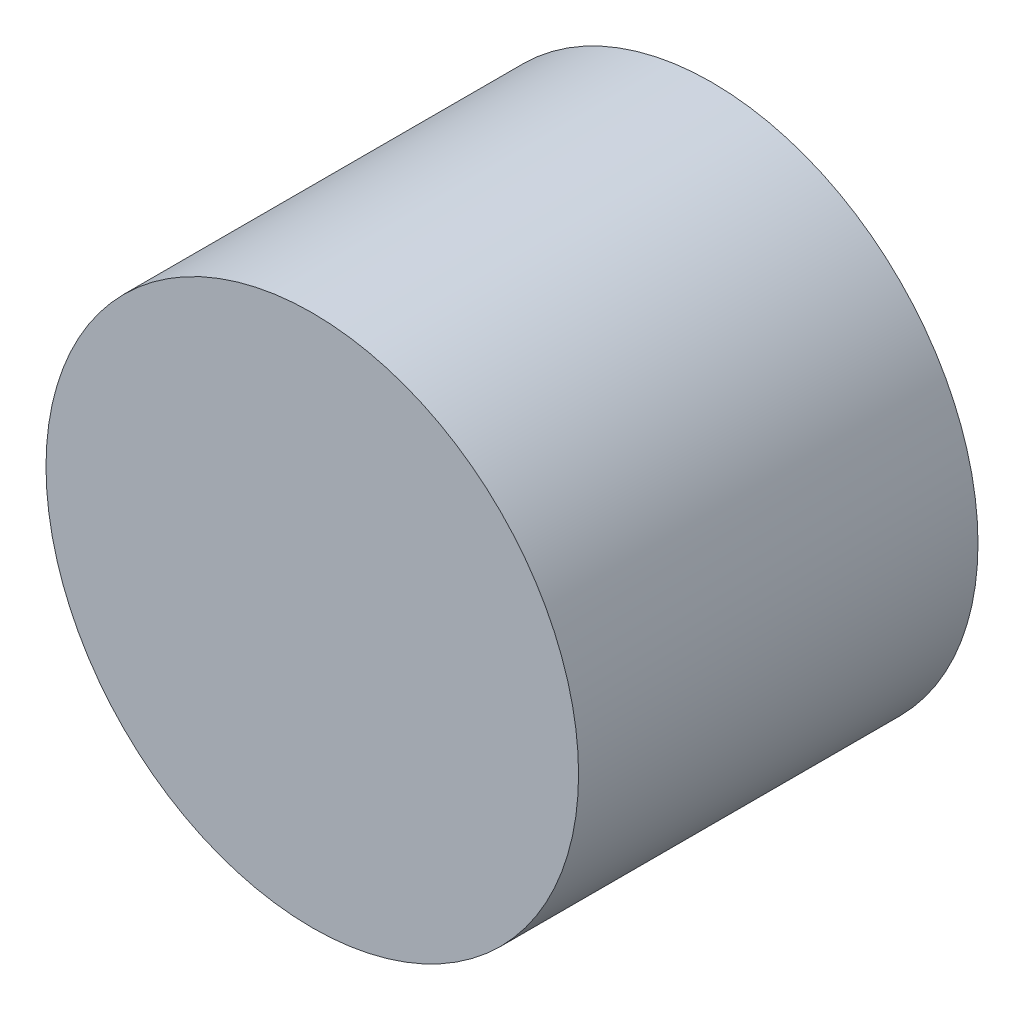
ISO-10303-21;
HEADER;
FILE_DESCRIPTION(('STEP AP214'),'2;1');
FILE_NAME('part.step','',(''),(''),'','','');
FILE_SCHEMA(('AUTOMOTIVE_DESIGN { 1 0 10303 214 1 1 1 1 }'));
ENDSEC;
DATA;
#1=APPLICATION_CONTEXT('core data for automotive mechanical design processes');
#2=APPLICATION_PROTOCOL_DEFINITION('international standard','automotive_design',2000,#1);
#3=PRODUCT_CONTEXT('',#1,'mechanical');
#4=PRODUCT('Part','Part','',(#3));
#5=PRODUCT_RELATED_PRODUCT_CATEGORY('part','',(#4));
#6=PRODUCT_DEFINITION_FORMATION('','',#4);
#7=PRODUCT_DEFINITION_CONTEXT('part definition',#1,'design');
#8=PRODUCT_DEFINITION('design','',#6,#7);
#9=PRODUCT_DEFINITION_SHAPE('','',#8);
#10=(LENGTH_UNIT() NAMED_UNIT(*) SI_UNIT(.MILLI.,.METRE.));
#11=(NAMED_UNIT(*) PLANE_ANGLE_UNIT() SI_UNIT($,.RADIAN.));
#12=(NAMED_UNIT(*) SI_UNIT($,.STERADIAN.) SOLID_ANGLE_UNIT());
#13=UNCERTAINTY_MEASURE_WITH_UNIT(LENGTH_MEASURE(1.E-05),#10,'distance_accuracy_value','');
#14=(GEOMETRIC_REPRESENTATION_CONTEXT(3) GLOBAL_UNCERTAINTY_ASSIGNED_CONTEXT((#13)) GLOBAL_UNIT_ASSIGNED_CONTEXT((#10,
#11,#12)) REPRESENTATION_CONTEXT('',''));
#15=CARTESIAN_POINT('',(0.,0.,0.));
#16=DIRECTION('',(0.,0.,1.));
#17=DIRECTION('',(1.,0.,0.));
#18=AXIS2_PLACEMENT_3D('',#15,#16,#17);
#19=CARTESIAN_POINT('',(2.05120407015315E-12,-25.3999999999999,19.05));
#20=DIRECTION('',(0.,0.,-1.));
#21=DIRECTION('',(-1.,0.,0.));
#22=AXIS2_PLACEMENT_3D('',#19,#20,#21);
#23=CYLINDRICAL_SURFACE('',#22,12.7);
#24=CARTESIAN_POINT('',(2.05120407015315E-12,-25.3999999999999,19.05));
#25=DIRECTION('',(0.,0.,1.));
#26=DIRECTION('',(1.,0.,0.));
#27=AXIS2_PLACEMENT_3D('',#24,#25,#26);
#28=CIRCLE('',#27,12.7);
#29=CARTESIAN_POINT('',(12.700000000002,-25.3999999999999,19.05));
#30=VERTEX_POINT('',#29);
#31=EDGE_CURVE('E10',#30,#30,#28,.T.);
#32=ORIENTED_EDGE('',*,*,#31,.F.);
#33=EDGE_LOOP('',(#32));
#34=FACE_BOUND('',#33,.T.);
#35=CARTESIAN_POINT('',(2.05120407015315E-12,-25.3999999999999,0.));
#36=DIRECTION('',(0.,0.,1.));
#37=DIRECTION('',(1.,0.,0.));
#38=AXIS2_PLACEMENT_3D('',#35,#36,#37);
#39=CIRCLE('',#38,12.7);
#40=CARTESIAN_POINT('',(12.700000000002,-25.3999999999999,0.));
#41=VERTEX_POINT('',#40);
#42=EDGE_CURVE('E34',#41,#41,#39,.T.);
#43=ORIENTED_EDGE('',*,*,#42,.T.);
#44=EDGE_LOOP('',(#43));
#45=FACE_BOUND('',#44,.T.);
#46=ADVANCED_FACE('F31',(#34,#45),#23,.T.);
#47=CARTESIAN_POINT('',(2.05120407015315E-12,-25.3999999999999,19.05));
#48=DIRECTION('',(0.,0.,1.));
#49=DIRECTION('',(1.,0.,0.));
#50=AXIS2_PLACEMENT_3D('',#47,#48,#49);
#51=PLANE('',#50);
#52=ORIENTED_EDGE('',*,*,#31,.T.);
#53=EDGE_LOOP('',(#52));
#54=FACE_BOUND('',#53,.T.);
#55=ADVANCED_FACE('F46',(#54),#51,.T.);
#56=CARTESIAN_POINT('',(2.05120407015315E-12,-25.3999999999999,0.));
#57=DIRECTION('',(0.,0.,1.));
#58=DIRECTION('',(1.,0.,0.));
#59=AXIS2_PLACEMENT_3D('',#56,#57,#58);
#60=PLANE('',#59);
#61=ORIENTED_EDGE('',*,*,#42,.F.);
#62=EDGE_LOOP('',(#61));
#63=FACE_BOUND('',#62,.T.);
#64=ADVANCED_FACE('F44',(#63),#60,.F.);
#65=CLOSED_SHELL('',(#46,#55,#64));
#66=MANIFOLD_SOLID_BREP('B2',#65);
#67=ADVANCED_BREP_SHAPE_REPRESENTATION('',(#18,#66),#14);
#68=SHAPE_DEFINITION_REPRESENTATION(#9,#67);
ENDSEC;
END-ISO-10303-21;
